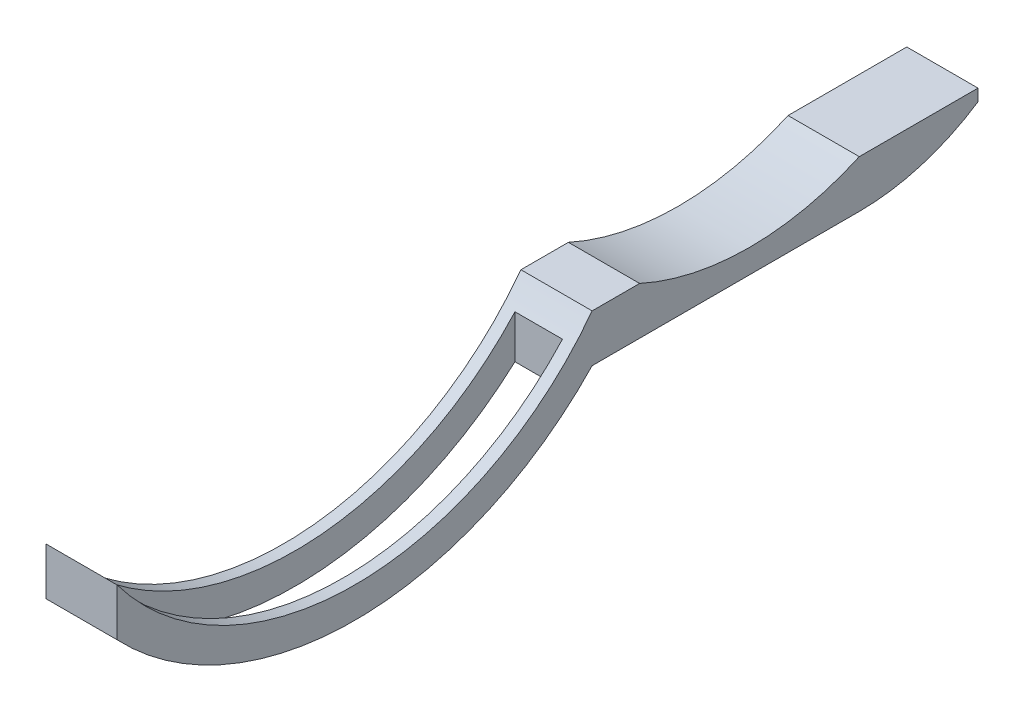
ISO-10303-21;
HEADER;
FILE_DESCRIPTION(('STEP AP214'),'2;1');
FILE_NAME('part.step','',(''),(''),'','','');
FILE_SCHEMA(('AUTOMOTIVE_DESIGN { 1 0 10303 214 1 1 1 1 }'));
ENDSEC;
DATA;
#1=APPLICATION_CONTEXT('core data for automotive mechanical design processes');
#2=APPLICATION_PROTOCOL_DEFINITION('international standard','automotive_design',2000,#1);
#3=PRODUCT_CONTEXT('',#1,'mechanical');
#4=PRODUCT('Part','Part','',(#3));
#5=PRODUCT_RELATED_PRODUCT_CATEGORY('part','',(#4));
#6=PRODUCT_DEFINITION_FORMATION('','',#4);
#7=PRODUCT_DEFINITION_CONTEXT('part definition',#1,'design');
#8=PRODUCT_DEFINITION('design','',#6,#7);
#9=PRODUCT_DEFINITION_SHAPE('','',#8);
#10=(LENGTH_UNIT() NAMED_UNIT(*) SI_UNIT(.MILLI.,.METRE.));
#11=(NAMED_UNIT(*) PLANE_ANGLE_UNIT() SI_UNIT($,.RADIAN.));
#12=(NAMED_UNIT(*) SI_UNIT($,.STERADIAN.) SOLID_ANGLE_UNIT());
#13=UNCERTAINTY_MEASURE_WITH_UNIT(LENGTH_MEASURE(1.E-05),#10,'distance_accuracy_value','');
#14=(GEOMETRIC_REPRESENTATION_CONTEXT(3) GLOBAL_UNCERTAINTY_ASSIGNED_CONTEXT((#13)) GLOBAL_UNIT_ASSIGNED_CONTEXT((#10,
#11,#12)) REPRESENTATION_CONTEXT('',''));
#15=CARTESIAN_POINT('',(0.,0.,0.));
#16=DIRECTION('',(0.,0.,1.));
#17=DIRECTION('',(1.,0.,0.));
#18=AXIS2_PLACEMENT_3D('',#15,#16,#17);
#19=CARTESIAN_POINT('',(12.,38.,-40.));
#20=DIRECTION('',(-1.,0.,0.));
#21=DIRECTION('',(0.,0.,1.));
#22=AXIS2_PLACEMENT_3D('',#19,#20,#21);
#23=CYLINDRICAL_SURFACE('',#22,55.1724568965349);
#24=DIRECTION('',(-1.,0.,0.));
#25=VECTOR('',#24,1.);
#26=CARTESIAN_POINT('',(12.,-2.,-2.));
#27=LINE('',#26,#25);
#28=CARTESIAN_POINT('',(2.00000000000001,-2.,-2.));
#29=VERTEX_POINT('',#28);
#30=CARTESIAN_POINT('',(10.,-2.,-2.));
#31=VERTEX_POINT('',#30);
#32=EDGE_CURVE('E256',#29,#31,#27,.F.);
#33=ORIENTED_EDGE('',*,*,#32,.T.);
#34=CARTESIAN_POINT('',(10.,38.,-40.));
#35=DIRECTION('',(1.,0.,0.));
#36=DIRECTION('',(0.,0.,-1.));
#37=AXIS2_PLACEMENT_3D('',#34,#35,#36);
#38=CIRCLE('',#37,55.1724568965349);
#39=CARTESIAN_POINT('',(10.,-2.92676385936226,-77.));
#40=VERTEX_POINT('',#39);
#41=EDGE_CURVE('E144',#31,#40,#38,.T.);
#42=ORIENTED_EDGE('',*,*,#41,.T.);
#43=DIRECTION('',(-1.,0.,0.));
#44=VECTOR('',#43,1.);
#45=CARTESIAN_POINT('',(12.,-2.92676385936226,-77.));
#46=LINE('',#45,#44);
#47=CARTESIAN_POINT('',(2.,-2.92676385936226,-77.));
#48=VERTEX_POINT('',#47);
#49=EDGE_CURVE('E250',#40,#48,#46,.T.);
#50=ORIENTED_EDGE('',*,*,#49,.T.);
#51=CARTESIAN_POINT('',(2.00000000000001,38.,-40.));
#52=DIRECTION('',(-1.,0.,0.));
#53=DIRECTION('',(0.,0.,1.));
#54=AXIS2_PLACEMENT_3D('',#51,#52,#53);
#55=CIRCLE('',#54,55.1724568965349);
#56=EDGE_CURVE('E221',#48,#29,#55,.T.);
#57=ORIENTED_EDGE('',*,*,#56,.T.);
#58=EDGE_LOOP('',(#33,#42,#50,#57));
#59=FACE_BOUND('',#58,.T.);
#60=CARTESIAN_POINT('',(0.,38.,-40.));
#61=DIRECTION('',(1.,0.,0.));
#62=DIRECTION('',(0.,0.,-1.));
#63=AXIS2_PLACEMENT_3D('',#60,#61,#62);
#64=CIRCLE('',#63,55.1724568965349);
#65=CARTESIAN_POINT('',(0.,0.,0.));
#66=VERTEX_POINT('',#65);
#67=CARTESIAN_POINT('',(0.,0.,-80.));
#68=VERTEX_POINT('',#67);
#69=EDGE_CURVE('E217',#66,#68,#64,.T.);
#70=ORIENTED_EDGE('',*,*,#69,.T.);
#71=DIRECTION('',(-1.,0.,0.));
#72=VECTOR('',#71,1.);
#73=CARTESIAN_POINT('',(12.,0.,-80.));
#74=LINE('',#73,#72);
#75=CARTESIAN_POINT('',(12.,0.,-80.));
#76=VERTEX_POINT('',#75);
#77=EDGE_CURVE('E138',#76,#68,#74,.T.);
#78=ORIENTED_EDGE('',*,*,#77,.F.);
#79=CARTESIAN_POINT('',(12.,38.,-40.));
#80=DIRECTION('',(1.,0.,0.));
#81=DIRECTION('',(0.,0.,-1.));
#82=AXIS2_PLACEMENT_3D('',#79,#80,#81);
#83=CIRCLE('',#82,55.1724568965349);
#84=CARTESIAN_POINT('',(12.,0.,0.));
#85=VERTEX_POINT('',#84);
#86=EDGE_CURVE('E195',#85,#76,#83,.T.);
#87=ORIENTED_EDGE('',*,*,#86,.F.);
#88=DIRECTION('',(-1.,0.,0.));
#89=VECTOR('',#88,1.);
#90=CARTESIAN_POINT('',(12.,0.,0.));
#91=LINE('',#90,#89);
#92=EDGE_CURVE('E187',#85,#66,#91,.T.);
#93=ORIENTED_EDGE('',*,*,#92,.T.);
#94=EDGE_LOOP('',(#70,#78,#87,#93));
#95=FACE_BOUND('',#94,.T.);
#96=ADVANCED_FACE('F39',(#59,#95),#23,.T.);
#97=CARTESIAN_POINT('',(12.,0.,-80.));
#98=DIRECTION('',(0.,1.,0.));
#99=DIRECTION('',(0.,0.,1.));
#100=AXIS2_PLACEMENT_3D('',#97,#98,#99);
#101=PLANE('',#100);
#102=DIRECTION('',(0.,0.,-1.));
#103=VECTOR('',#102,1.);
#104=CARTESIAN_POINT('',(0.,0.,-80.));
#105=LINE('',#104,#103);
#106=CARTESIAN_POINT('',(0.,0.,-125.));
#107=VERTEX_POINT('',#106);
#108=EDGE_CURVE('E214',#68,#107,#105,.T.);
#109=ORIENTED_EDGE('',*,*,#108,.T.);
#110=DIRECTION('',(-1.,0.,0.));
#111=VECTOR('',#110,1.);
#112=CARTESIAN_POINT('',(12.,0.,-125.));
#113=LINE('',#112,#111);
#114=CARTESIAN_POINT('',(12.,0.,-125.));
#115=VERTEX_POINT('',#114);
#116=EDGE_CURVE('E159',#115,#107,#113,.T.);
#117=ORIENTED_EDGE('',*,*,#116,.F.);
#118=DIRECTION('',(0.,0.,-1.));
#119=VECTOR('',#118,1.);
#120=CARTESIAN_POINT('',(12.,0.,-80.));
#121=LINE('',#120,#119);
#122=EDGE_CURVE('E242',#76,#115,#121,.T.);
#123=ORIENTED_EDGE('',*,*,#122,.F.);
#124=ORIENTED_EDGE('',*,*,#77,.T.);
#125=EDGE_LOOP('',(#109,#117,#123,#124));
#126=FACE_BOUND('',#125,.T.);
#127=ADVANCED_FACE('F275',(#126),#101,.F.);
#128=CARTESIAN_POINT('',(12.,36.3333333333334,-125.));
#129=DIRECTION('',(-1.,0.,0.));
#130=DIRECTION('',(0.,0.,1.));
#131=AXIS2_PLACEMENT_3D('',#128,#129,#130);
#132=CYLINDRICAL_SURFACE('',#131,36.3333333333334);
#133=CARTESIAN_POINT('',(0.,36.3333333333334,-125.));
#134=DIRECTION('',(1.,0.,0.));
#135=DIRECTION('',(0.,0.,1.));
#136=AXIS2_PLACEMENT_3D('',#133,#134,#135);
#137=CIRCLE('',#136,36.3333333333334);
#138=CARTESIAN_POINT('',(0.,6.,-145.));
#139=VERTEX_POINT('',#138);
#140=EDGE_CURVE('E211',#107,#139,#137,.T.);
#141=ORIENTED_EDGE('',*,*,#140,.T.);
#142=DIRECTION('',(-1.,0.,0.));
#143=VECTOR('',#142,1.);
#144=CARTESIAN_POINT('',(12.,6.,-145.));
#145=LINE('',#144,#143);
#146=CARTESIAN_POINT('',(12.,6.,-145.));
#147=VERTEX_POINT('',#146);
#148=EDGE_CURVE('E163',#147,#139,#145,.T.);
#149=ORIENTED_EDGE('',*,*,#148,.F.);
#150=CARTESIAN_POINT('',(12.,36.3333333333334,-125.));
#151=DIRECTION('',(1.,0.,0.));
#152=DIRECTION('',(0.,0.,1.));
#153=AXIS2_PLACEMENT_3D('',#150,#151,#152);
#154=CIRCLE('',#153,36.3333333333334);
#155=EDGE_CURVE('E239',#115,#147,#154,.T.);
#156=ORIENTED_EDGE('',*,*,#155,.F.);
#157=ORIENTED_EDGE('',*,*,#116,.T.);
#158=EDGE_LOOP('',(#141,#149,#156,#157));
#159=FACE_BOUND('',#158,.T.);
#160=ADVANCED_FACE('F317',(#159),#132,.T.);
#161=CARTESIAN_POINT('',(12.,8.,-145.));
#162=DIRECTION('',(0.,0.,1.));
#163=DIRECTION('',(1.,0.,0.));
#164=AXIS2_PLACEMENT_3D('',#161,#162,#163);
#165=PLANE('',#164);
#166=DIRECTION('',(0.,1.,0.));
#167=VECTOR('',#166,1.);
#168=CARTESIAN_POINT('',(0.,8.,-145.));
#169=LINE('',#168,#167);
#170=CARTESIAN_POINT('',(0.,8.,-145.));
#171=VERTEX_POINT('',#170);
#172=EDGE_CURVE('E208',#139,#171,#169,.T.);
#173=ORIENTED_EDGE('',*,*,#172,.T.);
#174=DIRECTION('',(-1.,0.,0.));
#175=VECTOR('',#174,1.);
#176=CARTESIAN_POINT('',(12.,8.,-145.));
#177=LINE('',#176,#175);
#178=CARTESIAN_POINT('',(12.,8.,-145.));
#179=VERTEX_POINT('',#178);
#180=EDGE_CURVE('E167',#179,#171,#177,.T.);
#181=ORIENTED_EDGE('',*,*,#180,.F.);
#182=DIRECTION('',(0.,1.,0.));
#183=VECTOR('',#182,1.);
#184=CARTESIAN_POINT('',(12.,8.,-145.));
#185=LINE('',#184,#183);
#186=EDGE_CURVE('E236',#147,#179,#185,.T.);
#187=ORIENTED_EDGE('',*,*,#186,.F.);
#188=ORIENTED_EDGE('',*,*,#148,.T.);
#189=EDGE_LOOP('',(#173,#181,#187,#188));
#190=FACE_BOUND('',#189,.T.);
#191=ADVANCED_FACE('F313',(#190),#165,.F.);
#192=CARTESIAN_POINT('',(12.,8.,-125.));
#193=DIRECTION('',(0.,-1.,0.));
#194=DIRECTION('',(0.,0.,-1.));
#195=AXIS2_PLACEMENT_3D('',#192,#193,#194);
#196=PLANE('',#195);
#197=DIRECTION('',(0.,0.,1.));
#198=VECTOR('',#197,1.);
#199=CARTESIAN_POINT('',(0.,8.,-125.));
#200=LINE('',#199,#198);
#201=CARTESIAN_POINT('',(0.,8.,-125.));
#202=VERTEX_POINT('',#201);
#203=EDGE_CURVE('E205',#171,#202,#200,.T.);
#204=ORIENTED_EDGE('',*,*,#203,.T.);
#205=DIRECTION('',(-1.,0.,0.));
#206=VECTOR('',#205,1.);
#207=CARTESIAN_POINT('',(12.,8.,-125.));
#208=LINE('',#207,#206);
#209=CARTESIAN_POINT('',(12.,8.,-125.));
#210=VERTEX_POINT('',#209);
#211=EDGE_CURVE('E171',#210,#202,#208,.T.);
#212=ORIENTED_EDGE('',*,*,#211,.F.);
#213=DIRECTION('',(0.,0.,1.));
#214=VECTOR('',#213,1.);
#215=CARTESIAN_POINT('',(12.,8.,-125.));
#216=LINE('',#215,#214);
#217=EDGE_CURVE('E233',#179,#210,#216,.T.);
#218=ORIENTED_EDGE('',*,*,#217,.F.);
#219=ORIENTED_EDGE('',*,*,#180,.T.);
#220=EDGE_LOOP('',(#204,#212,#218,#219));
#221=FACE_BOUND('',#220,.T.);
#222=ADVANCED_FACE('F310',(#221),#196,.F.);
#223=CARTESIAN_POINT('',(12.,48.78125,-106.5));
#224=DIRECTION('',(-1.,0.,0.));
#225=DIRECTION('',(0.,0.,1.));
#226=AXIS2_PLACEMENT_3D('',#223,#224,#225);
#227=CYLINDRICAL_SURFACE('',#226,44.78125);
#228=CARTESIAN_POINT('',(0.,48.78125,-106.5));
#229=DIRECTION('',(-1.,0.,0.));
#230=DIRECTION('',(0.,0.,-1.));
#231=AXIS2_PLACEMENT_3D('',#228,#229,#230);
#232=CIRCLE('',#231,44.78125);
#233=CARTESIAN_POINT('',(0.,8.,-88.));
#234=VERTEX_POINT('',#233);
#235=EDGE_CURVE('E202',#202,#234,#232,.T.);
#236=ORIENTED_EDGE('',*,*,#235,.T.);
#237=DIRECTION('',(-1.,0.,0.));
#238=VECTOR('',#237,1.);
#239=CARTESIAN_POINT('',(12.,8.,-88.));
#240=LINE('',#239,#238);
#241=CARTESIAN_POINT('',(12.,8.,-88.));
#242=VERTEX_POINT('',#241);
#243=EDGE_CURVE('E175',#242,#234,#240,.T.);
#244=ORIENTED_EDGE('',*,*,#243,.F.);
#245=CARTESIAN_POINT('',(12.,48.78125,-106.5));
#246=DIRECTION('',(-1.,0.,0.));
#247=DIRECTION('',(0.,0.,-1.));
#248=AXIS2_PLACEMENT_3D('',#245,#246,#247);
#249=CIRCLE('',#248,44.78125);
#250=EDGE_CURVE('E230',#210,#242,#249,.T.);
#251=ORIENTED_EDGE('',*,*,#250,.F.);
#252=ORIENTED_EDGE('',*,*,#211,.T.);
#253=EDGE_LOOP('',(#236,#244,#251,#252));
#254=FACE_BOUND('',#253,.T.);
#255=ADVANCED_FACE('F306',(#254),#227,.F.);
#256=CARTESIAN_POINT('',(12.,8.,-80.));
#257=DIRECTION('',(0.,-1.,0.));
#258=DIRECTION('',(0.,0.,-1.));
#259=AXIS2_PLACEMENT_3D('',#256,#257,#258);
#260=PLANE('',#259);
#261=DIRECTION('',(0.,0.,1.));
#262=VECTOR('',#261,1.);
#263=CARTESIAN_POINT('',(0.,8.,-80.));
#264=LINE('',#263,#262);
#265=CARTESIAN_POINT('',(0.,7.99999999999999,-80.));
#266=VERTEX_POINT('',#265);
#267=EDGE_CURVE('E199',#234,#266,#264,.T.);
#268=ORIENTED_EDGE('',*,*,#267,.T.);
#269=DIRECTION('',(-1.,0.,0.));
#270=VECTOR('',#269,1.);
#271=CARTESIAN_POINT('',(12.,7.99999999999999,-80.));
#272=LINE('',#271,#270);
#273=CARTESIAN_POINT('',(12.,7.99999999999999,-80.));
#274=VERTEX_POINT('',#273);
#275=EDGE_CURVE('E179',#274,#266,#272,.T.);
#276=ORIENTED_EDGE('',*,*,#275,.F.);
#277=DIRECTION('',(0.,0.,1.));
#278=VECTOR('',#277,1.);
#279=CARTESIAN_POINT('',(12.,8.,-80.));
#280=LINE('',#279,#278);
#281=EDGE_CURVE('E227',#242,#274,#280,.T.);
#282=ORIENTED_EDGE('',*,*,#281,.F.);
#283=ORIENTED_EDGE('',*,*,#243,.T.);
#284=EDGE_LOOP('',(#268,#276,#282,#283));
#285=FACE_BOUND('',#284,.T.);
#286=ADVANCED_FACE('F301',(#285),#260,.F.);
#287=CARTESIAN_POINT('',(12.,38.,-40.));
#288=DIRECTION('',(-1.,0.,0.));
#289=DIRECTION('',(0.,0.,1.));
#290=AXIS2_PLACEMENT_3D('',#287,#288,#289);
#291=CYLINDRICAL_SURFACE('',#290,50.);
#292=DIRECTION('',(-1.,0.,0.));
#293=VECTOR('',#292,1.);
#294=CARTESIAN_POINT('',(12.,5.50384638145616,-2.));
#295=LINE('',#294,#293);
#296=CARTESIAN_POINT('',(10.,5.50384638145616,-2.));
#297=VERTEX_POINT('',#296);
#298=CARTESIAN_POINT('',(2.00000000000001,5.50384638145616,-2.));
#299=VERTEX_POINT('',#298);
#300=EDGE_CURVE('E132',#297,#299,#295,.T.);
#301=ORIENTED_EDGE('',*,*,#300,.T.);
#302=CARTESIAN_POINT('',(2.00000000000001,38.,-40.));
#303=DIRECTION('',(-1.,0.,0.));
#304=DIRECTION('',(0.,0.,1.));
#305=AXIS2_PLACEMENT_3D('',#302,#303,#304);
#306=CIRCLE('',#305,50.);
#307=CARTESIAN_POINT('',(2.,4.36965655839951,-77.));
#308=VERTEX_POINT('',#307);
#309=EDGE_CURVE('E11',#299,#308,#306,.F.);
#310=ORIENTED_EDGE('',*,*,#309,.T.);
#311=DIRECTION('',(-1.,0.,0.));
#312=VECTOR('',#311,1.);
#313=CARTESIAN_POINT('',(12.,4.36965655839951,-77.));
#314=LINE('',#313,#312);
#315=CARTESIAN_POINT('',(10.,4.36965655839951,-77.));
#316=VERTEX_POINT('',#315);
#317=EDGE_CURVE('E47',#308,#316,#314,.F.);
#318=ORIENTED_EDGE('',*,*,#317,.T.);
#319=CARTESIAN_POINT('',(10.,38.,-40.));
#320=DIRECTION('',(1.,0.,0.));
#321=DIRECTION('',(0.,0.,-1.));
#322=AXIS2_PLACEMENT_3D('',#319,#320,#321);
#323=CIRCLE('',#322,50.);
#324=EDGE_CURVE('E137',#316,#297,#323,.F.);
#325=ORIENTED_EDGE('',*,*,#324,.T.);
#326=EDGE_LOOP('',(#301,#310,#318,#325));
#327=FACE_BOUND('',#326,.T.);
#328=CARTESIAN_POINT('',(0.,38.,-40.));
#329=DIRECTION('',(-1.,0.,0.));
#330=DIRECTION('',(0.,0.,-1.));
#331=AXIS2_PLACEMENT_3D('',#328,#329,#330);
#332=CIRCLE('',#331,50.);
#333=CARTESIAN_POINT('',(0.,8.,0.));
#334=VERTEX_POINT('',#333);
#335=EDGE_CURVE('E196',#266,#334,#332,.T.);
#336=ORIENTED_EDGE('',*,*,#335,.T.);
#337=DIRECTION('',(-1.,0.,0.));
#338=VECTOR('',#337,1.);
#339=CARTESIAN_POINT('',(12.,8.,0.));
#340=LINE('',#339,#338);
#341=CARTESIAN_POINT('',(12.,8.,0.));
#342=VERTEX_POINT('',#341);
#343=EDGE_CURVE('E183',#342,#334,#340,.T.);
#344=ORIENTED_EDGE('',*,*,#343,.F.);
#345=CARTESIAN_POINT('',(12.,38.,-40.));
#346=DIRECTION('',(-1.,0.,0.));
#347=DIRECTION('',(0.,0.,-1.));
#348=AXIS2_PLACEMENT_3D('',#345,#346,#347);
#349=CIRCLE('',#348,50.);
#350=EDGE_CURVE('E224',#274,#342,#349,.T.);
#351=ORIENTED_EDGE('',*,*,#350,.F.);
#352=ORIENTED_EDGE('',*,*,#275,.T.);
#353=EDGE_LOOP('',(#336,#344,#351,#352));
#354=FACE_BOUND('',#353,.T.);
#355=ADVANCED_FACE('F150',(#327,#354),#291,.F.);
#356=CARTESIAN_POINT('',(12.,0.,0.));
#357=DIRECTION('',(0.,0.,-1.));
#358=DIRECTION('',(-1.,0.,0.));
#359=AXIS2_PLACEMENT_3D('',#356,#357,#358);
#360=PLANE('',#359);
#361=DIRECTION('',(0.,-1.,0.));
#362=VECTOR('',#361,1.);
#363=CARTESIAN_POINT('',(0.,0.,0.));
#364=LINE('',#363,#362);
#365=EDGE_CURVE('E192',#334,#66,#364,.T.);
#366=ORIENTED_EDGE('',*,*,#365,.T.);
#367=ORIENTED_EDGE('',*,*,#92,.F.);
#368=DIRECTION('',(0.,-1.,0.));
#369=VECTOR('',#368,1.);
#370=CARTESIAN_POINT('',(12.,0.,0.));
#371=LINE('',#370,#369);
#372=EDGE_CURVE('E191',#342,#85,#371,.T.);
#373=ORIENTED_EDGE('',*,*,#372,.F.);
#374=ORIENTED_EDGE('',*,*,#343,.T.);
#375=EDGE_LOOP('',(#366,#367,#373,#374));
#376=FACE_BOUND('',#375,.T.);
#377=ADVANCED_FACE('F295',(#376),#360,.F.);
#378=CARTESIAN_POINT('',(12.,38.,-40.));
#379=DIRECTION('',(1.,0.,0.));
#380=DIRECTION('',(0.,0.,-1.));
#381=AXIS2_PLACEMENT_3D('',#378,#379,#380);
#382=PLANE('',#381);
#383=ORIENTED_EDGE('',*,*,#86,.T.);
#384=ORIENTED_EDGE('',*,*,#122,.T.);
#385=ORIENTED_EDGE('',*,*,#155,.T.);
#386=ORIENTED_EDGE('',*,*,#186,.T.);
#387=ORIENTED_EDGE('',*,*,#217,.T.);
#388=ORIENTED_EDGE('',*,*,#250,.T.);
#389=ORIENTED_EDGE('',*,*,#281,.T.);
#390=ORIENTED_EDGE('',*,*,#350,.T.);
#391=ORIENTED_EDGE('',*,*,#372,.T.);
#392=EDGE_LOOP('',(#383,#384,#385,#386,#387,#388,#389,#390,#391));
#393=FACE_BOUND('',#392,.T.);
#394=ADVANCED_FACE('F290',(#393),#382,.T.);
#395=CARTESIAN_POINT('',(0.,38.,-40.));
#396=DIRECTION('',(1.,0.,0.));
#397=DIRECTION('',(0.,0.,-1.));
#398=AXIS2_PLACEMENT_3D('',#395,#396,#397);
#399=PLANE('',#398);
#400=ORIENTED_EDGE('',*,*,#69,.F.);
#401=ORIENTED_EDGE('',*,*,#365,.F.);
#402=ORIENTED_EDGE('',*,*,#335,.F.);
#403=ORIENTED_EDGE('',*,*,#267,.F.);
#404=ORIENTED_EDGE('',*,*,#235,.F.);
#405=ORIENTED_EDGE('',*,*,#203,.F.);
#406=ORIENTED_EDGE('',*,*,#172,.F.);
#407=ORIENTED_EDGE('',*,*,#140,.F.);
#408=ORIENTED_EDGE('',*,*,#108,.F.);
#409=EDGE_LOOP('',(#400,#401,#402,#403,#404,#405,#406,#407,#408));
#410=FACE_BOUND('',#409,.T.);
#411=ADVANCED_FACE('F282',(#410),#399,.F.);
#412=CARTESIAN_POINT('',(2.,-17.1724568965349,-77.));
#413=DIRECTION('',(-1.,0.,0.));
#414=DIRECTION('',(0.,0.,1.));
#415=AXIS2_PLACEMENT_3D('',#412,#413,#414);
#416=PLANE('',#415);
#417=DIRECTION('',(0.,1.,0.));
#418=VECTOR('',#417,1.);
#419=CARTESIAN_POINT('',(2.,-17.1724568965349,-77.));
#420=LINE('',#419,#418);
#421=EDGE_CURVE('E259',#48,#308,#420,.T.);
#422=ORIENTED_EDGE('',*,*,#421,.T.);
#423=ORIENTED_EDGE('',*,*,#309,.F.);
#424=DIRECTION('',(0.,1.,0.));
#425=VECTOR('',#424,1.);
#426=CARTESIAN_POINT('',(2.00000000000001,-17.1724568965349,-2.));
#427=LINE('',#426,#425);
#428=EDGE_CURVE('E59',#29,#299,#427,.T.);
#429=ORIENTED_EDGE('',*,*,#428,.F.);
#430=ORIENTED_EDGE('',*,*,#56,.F.);
#431=EDGE_LOOP('',(#422,#423,#429,#430));
#432=FACE_BOUND('',#431,.T.);
#433=ADVANCED_FACE('F268',(#432),#416,.F.);
#434=CARTESIAN_POINT('',(2.,-17.1724568965349,-77.));
#435=DIRECTION('',(0.,0.,-1.));
#436=DIRECTION('',(-1.,0.,0.));
#437=AXIS2_PLACEMENT_3D('',#434,#435,#436);
#438=PLANE('',#437);
#439=DIRECTION('',(0.,1.,0.));
#440=VECTOR('',#439,1.);
#441=CARTESIAN_POINT('',(10.,-17.1724568965349,-77.));
#442=LINE('',#441,#440);
#443=EDGE_CURVE('E147',#40,#316,#442,.T.);
#444=ORIENTED_EDGE('',*,*,#443,.T.);
#445=ORIENTED_EDGE('',*,*,#317,.F.);
#446=ORIENTED_EDGE('',*,*,#421,.F.);
#447=ORIENTED_EDGE('',*,*,#49,.F.);
#448=EDGE_LOOP('',(#444,#445,#446,#447));
#449=FACE_BOUND('',#448,.T.);
#450=ADVANCED_FACE('F271',(#449),#438,.F.);
#451=CARTESIAN_POINT('',(10.,-17.1724568965349,-77.));
#452=DIRECTION('',(1.,0.,0.));
#453=DIRECTION('',(0.,0.,-1.));
#454=AXIS2_PLACEMENT_3D('',#451,#452,#453);
#455=PLANE('',#454);
#456=DIRECTION('',(0.,1.,0.));
#457=VECTOR('',#456,1.);
#458=CARTESIAN_POINT('',(10.,-17.1724568965349,-2.));
#459=LINE('',#458,#457);
#460=EDGE_CURVE('E54',#31,#297,#459,.T.);
#461=ORIENTED_EDGE('',*,*,#460,.T.);
#462=ORIENTED_EDGE('',*,*,#324,.F.);
#463=ORIENTED_EDGE('',*,*,#443,.F.);
#464=ORIENTED_EDGE('',*,*,#41,.F.);
#465=EDGE_LOOP('',(#461,#462,#463,#464));
#466=FACE_BOUND('',#465,.T.);
#467=ADVANCED_FACE('F141',(#466),#455,.F.);
#468=CARTESIAN_POINT('',(2.00000000000001,-17.1724568965349,-2.));
#469=DIRECTION('',(0.,0.,1.));
#470=DIRECTION('',(1.,0.,0.));
#471=AXIS2_PLACEMENT_3D('',#468,#469,#470);
#472=PLANE('',#471);
#473=ORIENTED_EDGE('',*,*,#428,.T.);
#474=ORIENTED_EDGE('',*,*,#300,.F.);
#475=ORIENTED_EDGE('',*,*,#460,.F.);
#476=ORIENTED_EDGE('',*,*,#32,.F.);
#477=EDGE_LOOP('',(#473,#474,#475,#476));
#478=FACE_BOUND('',#477,.T.);
#479=ADVANCED_FACE('F133',(#478),#472,.F.);
#480=CLOSED_SHELL('',(#96,#127,#160,#191,#222,#255,#286,#355,#377,#394,#411,#433,#450,#467,#479));
#481=MANIFOLD_SOLID_BREP('B2',#480);
#482=ADVANCED_BREP_SHAPE_REPRESENTATION('',(#18,#481),#14);
#483=SHAPE_DEFINITION_REPRESENTATION(#9,#482);
ENDSEC;
END-ISO-10303-21;
